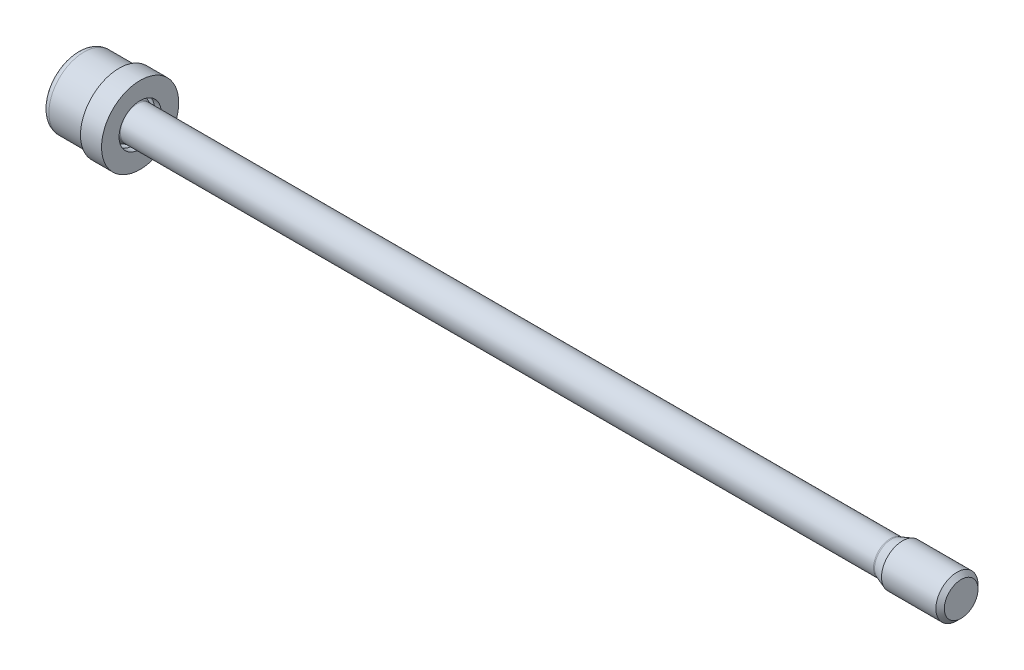
ISO-10303-21;
HEADER;
FILE_DESCRIPTION(('STEP AP214'),'2;1');
FILE_NAME('part.step','',(''),(''),'','','');
FILE_SCHEMA(('AUTOMOTIVE_DESIGN { 1 0 10303 214 1 1 1 1 }'));
ENDSEC;
DATA;
#1=APPLICATION_CONTEXT('core data for automotive mechanical design processes');
#2=APPLICATION_PROTOCOL_DEFINITION('international standard','automotive_design',2000,#1);
#3=PRODUCT_CONTEXT('',#1,'mechanical');
#4=PRODUCT('Part','Part','',(#3));
#5=PRODUCT_RELATED_PRODUCT_CATEGORY('part','',(#4));
#6=PRODUCT_DEFINITION_FORMATION('','',#4);
#7=PRODUCT_DEFINITION_CONTEXT('part definition',#1,'design');
#8=PRODUCT_DEFINITION('design','',#6,#7);
#9=PRODUCT_DEFINITION_SHAPE('','',#8);
#10=(LENGTH_UNIT() NAMED_UNIT(*) SI_UNIT(.MILLI.,.METRE.));
#11=(NAMED_UNIT(*) PLANE_ANGLE_UNIT() SI_UNIT($,.RADIAN.));
#12=(NAMED_UNIT(*) SI_UNIT($,.STERADIAN.) SOLID_ANGLE_UNIT());
#13=UNCERTAINTY_MEASURE_WITH_UNIT(LENGTH_MEASURE(1.E-05),#10,'distance_accuracy_value','');
#14=(GEOMETRIC_REPRESENTATION_CONTEXT(3) GLOBAL_UNCERTAINTY_ASSIGNED_CONTEXT((#13)) GLOBAL_UNIT_ASSIGNED_CONTEXT((#10,
#11,#12)) REPRESENTATION_CONTEXT('',''));
#15=CARTESIAN_POINT('',(0.,0.,0.));
#16=DIRECTION('',(0.,0.,1.));
#17=DIRECTION('',(1.,0.,0.));
#18=AXIS2_PLACEMENT_3D('',#15,#16,#17);
#19=CARTESIAN_POINT('',(6.,3.75,0.));
#20=DIRECTION('',(1.,0.,0.));
#21=DIRECTION('',(0.,0.,-1.));
#22=AXIS2_PLACEMENT_3D('',#19,#20,#21);
#23=PLANE('',#22);
#24=CARTESIAN_POINT('',(6.,0.,0.));
#25=DIRECTION('',(-1.,0.,0.));
#26=DIRECTION('',(0.,0.,1.));
#27=AXIS2_PLACEMENT_3D('',#24,#25,#26);
#28=CIRCLE('',#27,3.75);
#29=CARTESIAN_POINT('',(6.,0.,3.75));
#30=VERTEX_POINT('',#29);
#31=EDGE_CURVE('E62',#30,#30,#28,.T.);
#32=ORIENTED_EDGE('',*,*,#31,.F.);
#33=EDGE_LOOP('',(#32));
#34=FACE_BOUND('',#33,.T.);
#35=CARTESIAN_POINT('',(6.,0.,0.));
#36=DIRECTION('',(-1.,0.,0.));
#37=DIRECTION('',(0.,0.,1.));
#38=AXIS2_PLACEMENT_3D('',#35,#36,#37);
#39=CIRCLE('',#38,5.5);
#40=CARTESIAN_POINT('',(6.,0.,5.5));
#41=VERTEX_POINT('',#40);
#42=EDGE_CURVE('E11',#41,#41,#39,.T.);
#43=ORIENTED_EDGE('',*,*,#42,.T.);
#44=EDGE_LOOP('',(#43));
#45=FACE_BOUND('',#44,.T.);
#46=ADVANCED_FACE('F43',(#34,#45),#23,.F.);
#47=CARTESIAN_POINT('',(0.,0.,0.));
#48=DIRECTION('',(-1.,0.,0.));
#49=DIRECTION('',(0.,0.,1.));
#50=AXIS2_PLACEMENT_3D('',#47,#48,#49);
#51=CYLINDRICAL_SURFACE('',#50,5.5);
#52=ORIENTED_EDGE('',*,*,#42,.F.);
#53=EDGE_LOOP('',(#52));
#54=FACE_BOUND('',#53,.T.);
#55=CARTESIAN_POINT('',(9.,0.,0.));
#56=DIRECTION('',(-1.,0.,0.));
#57=DIRECTION('',(0.,0.,1.));
#58=AXIS2_PLACEMENT_3D('',#55,#56,#57);
#59=CIRCLE('',#58,5.5);
#60=CARTESIAN_POINT('',(9.,0.,5.5));
#61=VERTEX_POINT('',#60);
#62=EDGE_CURVE('E49',#61,#61,#59,.T.);
#63=ORIENTED_EDGE('',*,*,#62,.T.);
#64=EDGE_LOOP('',(#63));
#65=FACE_BOUND('',#64,.T.);
#66=ADVANCED_FACE('F69',(#54,#65),#51,.T.);
#67=CARTESIAN_POINT('',(9.,5.5,0.));
#68=DIRECTION('',(-1.,0.,0.));
#69=DIRECTION('',(0.,0.,1.));
#70=AXIS2_PLACEMENT_3D('',#67,#68,#69);
#71=PLANE('',#70);
#72=ORIENTED_EDGE('',*,*,#62,.F.);
#73=EDGE_LOOP('',(#72));
#74=FACE_BOUND('',#73,.T.);
#75=CARTESIAN_POINT('',(9.,0.,0.));
#76=DIRECTION('',(-1.,0.,0.));
#77=DIRECTION('',(0.,0.,1.));
#78=AXIS2_PLACEMENT_3D('',#75,#76,#77);
#79=CIRCLE('',#78,3.);
#80=CARTESIAN_POINT('',(9.,0.,3.));
#81=VERTEX_POINT('',#80);
#82=EDGE_CURVE('E53',#81,#81,#79,.T.);
#83=ORIENTED_EDGE('',*,*,#82,.T.);
#84=EDGE_LOOP('',(#83));
#85=FACE_BOUND('',#84,.T.);
#86=ADVANCED_FACE('F73',(#74,#85),#71,.F.);
#87=CARTESIAN_POINT('',(0.,0.,0.));
#88=DIRECTION('',(-1.,0.,0.));
#89=DIRECTION('',(0.,0.,1.));
#90=AXIS2_PLACEMENT_3D('',#87,#88,#89);
#91=CYLINDRICAL_SURFACE('',#90,3.);
#92=ORIENTED_EDGE('',*,*,#82,.F.);
#93=EDGE_LOOP('',(#92));
#94=FACE_BOUND('',#93,.T.);
#95=CARTESIAN_POINT('',(8.06060806459101,0.,0.));
#96=DIRECTION('',(-1.,0.,0.));
#97=DIRECTION('',(0.,0.,1.));
#98=AXIS2_PLACEMENT_3D('',#95,#96,#97);
#99=CIRCLE('',#98,3.);
#100=CARTESIAN_POINT('',(8.06060806459101,0.,3.));
#101=VERTEX_POINT('',#100);
#102=EDGE_CURVE('E57',#101,#101,#99,.T.);
#103=ORIENTED_EDGE('',*,*,#102,.T.);
#104=EDGE_LOOP('',(#103));
#105=FACE_BOUND('',#104,.T.);
#106=ADVANCED_FACE('F78',(#94,#105),#91,.F.);
#107=CARTESIAN_POINT('',(6.,0.,0.));
#108=DIRECTION('',(-1.,0.,0.));
#109=DIRECTION('',(0.,0.,1.));
#110=AXIS2_PLACEMENT_3D('',#107,#108,#109);
#111=CONICAL_SURFACE('',#110,3.75,0.34906585039886);
#112=ORIENTED_EDGE('',*,*,#102,.F.);
#113=EDGE_LOOP('',(#112));
#114=FACE_BOUND('',#113,.T.);
#115=ORIENTED_EDGE('',*,*,#31,.T.);
#116=EDGE_LOOP('',(#115));
#117=FACE_BOUND('',#116,.T.);
#118=ADVANCED_FACE('F66',(#114,#117),#111,.F.);
#119=CLOSED_SHELL('',(#46,#66,#86,#106,#118));
#120=MANIFOLD_SOLID_BREP('B2',#119);
#121=CARTESIAN_POINT('',(0.,3.,0.));
#122=DIRECTION('',(-1.,0.,0.));
#123=DIRECTION('',(0.,0.,1.));
#124=AXIS2_PLACEMENT_3D('',#121,#122,#123);
#125=PLANE('',#124);
#126=CARTESIAN_POINT('',(0.,0.,0.));
#127=DIRECTION('',(-1.,0.,0.));
#128=DIRECTION('',(0.,0.,1.));
#129=AXIS2_PLACEMENT_3D('',#126,#127,#128);
#130=CIRCLE('',#129,4.);
#131=CARTESIAN_POINT('',(0.,0.,4.));
#132=VERTEX_POINT('',#131);
#133=EDGE_CURVE('E332',#132,#132,#130,.T.);
#134=ORIENTED_EDGE('',*,*,#133,.T.);
#135=EDGE_LOOP('',(#134));
#136=FACE_BOUND('',#135,.T.);
#137=DIRECTION('',(0.,-0.866025403784439,-0.5));
#138=VECTOR('',#137,1.);
#139=CARTESIAN_POINT('',(0.,2.5,-1.44337567297406));
#140=LINE('',#139,#138);
#141=CARTESIAN_POINT('',(0.,2.5,-1.44337567297406));
#142=VERTEX_POINT('',#141);
#143=CARTESIAN_POINT('',(0.,0.,-2.88675134594813));
#144=VERTEX_POINT('',#143);
#145=EDGE_CURVE('E190',#142,#144,#140,.T.);
#146=ORIENTED_EDGE('',*,*,#145,.F.);
#147=DIRECTION('',(0.,0.,-1.));
#148=VECTOR('',#147,1.);
#149=CARTESIAN_POINT('',(0.,2.5,1.44337567297407));
#150=LINE('',#149,#148);
#151=CARTESIAN_POINT('',(0.,2.5,1.44337567297407));
#152=VERTEX_POINT('',#151);
#153=EDGE_CURVE('E202',#152,#142,#150,.T.);
#154=ORIENTED_EDGE('',*,*,#153,.F.);
#155=DIRECTION('',(0.,0.866025403784439,-0.5));
#156=VECTOR('',#155,1.);
#157=CARTESIAN_POINT('',(0.,0.,2.88675134594813));
#158=LINE('',#157,#156);
#159=CARTESIAN_POINT('',(0.,0.,2.88675134594813));
#160=VERTEX_POINT('',#159);
#161=EDGE_CURVE('E196',#160,#152,#158,.T.);
#162=ORIENTED_EDGE('',*,*,#161,.F.);
#163=DIRECTION('',(0.,0.866025403784438,0.5));
#164=VECTOR('',#163,1.);
#165=CARTESIAN_POINT('',(0.,-2.5,1.44337567297406));
#166=LINE('',#165,#164);
#167=CARTESIAN_POINT('',(0.,-2.5,1.44337567297406));
#168=VERTEX_POINT('',#167);
#169=EDGE_CURVE('E194',#168,#160,#166,.T.);
#170=ORIENTED_EDGE('',*,*,#169,.F.);
#171=DIRECTION('',(0.,0.,1.));
#172=VECTOR('',#171,1.);
#173=CARTESIAN_POINT('',(0.,-2.5,-1.44337567297407));
#174=LINE('',#173,#172);
#175=CARTESIAN_POINT('',(0.,-2.5,-1.44337567297407));
#176=VERTEX_POINT('',#175);
#177=EDGE_CURVE('E177',#176,#168,#174,.T.);
#178=ORIENTED_EDGE('',*,*,#177,.F.);
#179=DIRECTION('',(0.,-0.866025403784439,0.5));
#180=VECTOR('',#179,1.);
#181=CARTESIAN_POINT('',(0.,0.,-2.88675134594813));
#182=LINE('',#181,#180);
#183=EDGE_CURVE('E185',#144,#176,#182,.T.);
#184=ORIENTED_EDGE('',*,*,#183,.F.);
#185=EDGE_LOOP('',(#146,#154,#162,#170,#178,#184));
#186=FACE_BOUND('',#185,.T.);
#187=ADVANCED_FACE('F120',(#136,#186),#125,.T.);
#188=CARTESIAN_POINT('',(0.,0.,0.));
#189=DIRECTION('',(1.,0.,0.));
#190=DIRECTION('',(0.,0.,-1.));
#191=AXIS2_PLACEMENT_3D('',#188,#189,#190);
#192=CYLINDRICAL_SURFACE('',#191,5.);
#193=CARTESIAN_POINT('',(1.,0.,0.));
#194=DIRECTION('',(-1.,0.,0.));
#195=DIRECTION('',(0.,0.,1.));
#196=AXIS2_PLACEMENT_3D('',#193,#194,#195);
#197=CIRCLE('',#196,5.);
#198=CARTESIAN_POINT('',(1.,0.,5.));
#199=VERTEX_POINT('',#198);
#200=EDGE_CURVE('E342',#199,#199,#197,.F.);
#201=ORIENTED_EDGE('',*,*,#200,.T.);
#202=EDGE_LOOP('',(#201));
#203=FACE_BOUND('',#202,.T.);
#204=CARTESIAN_POINT('',(6.,0.,0.));
#205=DIRECTION('',(1.,0.,0.));
#206=DIRECTION('',(0.,0.,-1.));
#207=AXIS2_PLACEMENT_3D('',#204,#205,#206);
#208=CIRCLE('',#207,5.);
#209=CARTESIAN_POINT('',(6.,0.,-5.));
#210=VERTEX_POINT('',#209);
#211=EDGE_CURVE('E345',#210,#210,#208,.T.);
#212=ORIENTED_EDGE('',*,*,#211,.F.);
#213=EDGE_LOOP('',(#212));
#214=FACE_BOUND('',#213,.T.);
#215=ADVANCED_FACE('F297',(#203,#214),#192,.T.);
#216=CARTESIAN_POINT('',(6.,5.,0.));
#217=DIRECTION('',(1.,0.,0.));
#218=DIRECTION('',(0.,0.,-1.));
#219=AXIS2_PLACEMENT_3D('',#216,#217,#218);
#220=PLANE('',#219);
#221=CARTESIAN_POINT('',(6.,0.,0.));
#222=DIRECTION('',(1.,0.,0.));
#223=DIRECTION('',(0.,0.,-1.));
#224=AXIS2_PLACEMENT_3D('',#221,#222,#223);
#225=CIRCLE('',#224,3.66002935477036);
#226=CARTESIAN_POINT('',(6.,0.,-3.66002935477036));
#227=VERTEX_POINT('',#226);
#228=EDGE_CURVE('E41',#227,#227,#225,.F.);
#229=ORIENTED_EDGE('',*,*,#228,.T.);
#230=EDGE_LOOP('',(#229));
#231=FACE_BOUND('',#230,.T.);
#232=ORIENTED_EDGE('',*,*,#211,.T.);
#233=EDGE_LOOP('',(#232));
#234=FACE_BOUND('',#233,.T.);
#235=ADVANCED_FACE('F293',(#231,#234),#220,.T.);
#236=CARTESIAN_POINT('',(8.5,0.,0.));
#237=DIRECTION('',(-1.,0.,0.));
#238=DIRECTION('',(0.,0.,1.));
#239=AXIS2_PLACEMENT_3D('',#236,#237,#238);
#240=CONICAL_SURFACE('',#239,2.4,0.349065850398867);
#241=CARTESIAN_POINT('',(8.4171534186914,0.,0.));
#242=DIRECTION('',(-1.,0.,0.));
#243=DIRECTION('',(0.,0.,1.));
#244=AXIS2_PLACEMENT_3D('',#241,#242,#243);
#245=CIRCLE('',#244,2.43015368960705);
#246=CARTESIAN_POINT('',(8.4171534186914,0.,2.43015368960705));
#247=VERTEX_POINT('',#246);
#248=EDGE_CURVE('E128',#247,#247,#245,.T.);
#249=ORIENTED_EDGE('',*,*,#248,.T.);
#250=EDGE_LOOP('',(#249));
#251=FACE_BOUND('',#250,.T.);
#252=CARTESIAN_POINT('',(6.32898992833717,0.,0.));
#253=DIRECTION('',(-1.,0.,0.));
#254=DIRECTION('',(0.,0.,1.));
#255=AXIS2_PLACEMENT_3D('',#252,#253,#254);
#256=CIRCLE('',#255,3.19018304437741);
#257=CARTESIAN_POINT('',(6.32898992833717,0.,3.19018304437741));
#258=VERTEX_POINT('',#257);
#259=EDGE_CURVE('E329',#258,#258,#256,.F.);
#260=ORIENTED_EDGE('',*,*,#259,.T.);
#261=EDGE_LOOP('',(#260));
#262=FACE_BOUND('',#261,.T.);
#263=ADVANCED_FACE('F289',(#251,#262),#240,.T.);
#264=CARTESIAN_POINT('',(0.,0.,0.));
#265=DIRECTION('',(1.,0.,0.));
#266=DIRECTION('',(0.,0.,-1.));
#267=AXIS2_PLACEMENT_3D('',#264,#265,#266);
#268=CYLINDRICAL_SURFACE('',#267,2.4);
#269=CARTESIAN_POINT('',(115.911836509646,0.,0.));
#270=DIRECTION('',(1.,0.,0.));
#271=DIRECTION('',(0.,0.,-1.));
#272=AXIS2_PLACEMENT_3D('',#269,#270,#271);
#273=CIRCLE('',#272,2.4);
#274=CARTESIAN_POINT('',(115.911836509646,0.,-2.4));
#275=VERTEX_POINT('',#274);
#276=EDGE_CURVE('E325',#275,#275,#273,.F.);
#277=ORIENTED_EDGE('',*,*,#276,.T.);
#278=EDGE_LOOP('',(#277));
#279=FACE_BOUND('',#278,.T.);
#280=CARTESIAN_POINT('',(8.58816349035423,0.,0.));
#281=DIRECTION('',(1.,0.,0.));
#282=DIRECTION('',(0.,0.,-1.));
#283=AXIS2_PLACEMENT_3D('',#280,#281,#282);
#284=CIRCLE('',#283,2.4);
#285=CARTESIAN_POINT('',(8.58816349035423,0.,-2.4));
#286=VERTEX_POINT('',#285);
#287=EDGE_CURVE('E323',#286,#286,#284,.T.);
#288=ORIENTED_EDGE('',*,*,#287,.T.);
#289=EDGE_LOOP('',(#288));
#290=FACE_BOUND('',#289,.T.);
#291=ADVANCED_FACE('F285',(#279,#290),#268,.T.);
#292=CARTESIAN_POINT('',(117.648486451673,0.,0.));
#293=DIRECTION('',(1.,0.,0.));
#294=DIRECTION('',(0.,0.,-1.));
#295=AXIS2_PLACEMENT_3D('',#292,#293,#294);
#296=CONICAL_SURFACE('',#295,3.00000000000001,0.349065850398867);
#297=CARTESIAN_POINT('',(116.082846581309,0.,0.));
#298=DIRECTION('',(1.,0.,0.));
#299=DIRECTION('',(0.,0.,-1.));
#300=AXIS2_PLACEMENT_3D('',#297,#298,#299);
#301=CIRCLE('',#300,2.43015368960705);
#302=CARTESIAN_POINT('',(116.082846581309,0.,-2.43015368960705));
#303=VERTEX_POINT('',#302);
#304=EDGE_CURVE('E326',#303,#303,#301,.T.);
#305=ORIENTED_EDGE('',*,*,#304,.T.);
#306=EDGE_LOOP('',(#305));
#307=FACE_BOUND('',#306,.T.);
#308=CARTESIAN_POINT('',(117.648486451673,0.,0.));
#309=DIRECTION('',(1.,0.,0.));
#310=DIRECTION('',(0.,0.,-1.));
#311=AXIS2_PLACEMENT_3D('',#308,#309,#310);
#312=CIRCLE('',#311,3.00000000000001);
#313=CARTESIAN_POINT('',(117.648486451673,0.,-3.00000000000001));
#314=VERTEX_POINT('',#313);
#315=EDGE_CURVE('E348',#314,#314,#312,.T.);
#316=ORIENTED_EDGE('',*,*,#315,.F.);
#317=EDGE_LOOP('',(#316));
#318=FACE_BOUND('',#317,.T.);
#319=ADVANCED_FACE('F281',(#307,#318),#296,.T.);
#320=CARTESIAN_POINT('',(0.,0.,0.));
#321=DIRECTION('',(1.,0.,0.));
#322=DIRECTION('',(0.,0.,-1.));
#323=AXIS2_PLACEMENT_3D('',#320,#321,#322);
#324=CYLINDRICAL_SURFACE('',#323,3.00000000000001);
#325=ORIENTED_EDGE('',*,*,#315,.T.);
#326=EDGE_LOOP('',(#325));
#327=FACE_BOUND('',#326,.T.);
#328=CARTESIAN_POINT('',(125.4,0.,0.));
#329=DIRECTION('',(1.,0.,0.));
#330=DIRECTION('',(0.,0.,-1.));
#331=AXIS2_PLACEMENT_3D('',#328,#329,#330);
#332=CIRCLE('',#331,3.00000000000001);
#333=CARTESIAN_POINT('',(125.4,0.,-3.00000000000001));
#334=VERTEX_POINT('',#333);
#335=EDGE_CURVE('E350',#334,#334,#332,.T.);
#336=ORIENTED_EDGE('',*,*,#335,.F.);
#337=EDGE_LOOP('',(#336));
#338=FACE_BOUND('',#337,.T.);
#339=ADVANCED_FACE('F277',(#327,#338),#324,.T.);
#340=CARTESIAN_POINT('',(126.,0.,0.));
#341=DIRECTION('',(-1.,0.,0.));
#342=DIRECTION('',(0.,0.,1.));
#343=AXIS2_PLACEMENT_3D('',#340,#341,#342);
#344=CONICAL_SURFACE('',#343,2.4,0.785398163397422);
#345=ORIENTED_EDGE('',*,*,#335,.T.);
#346=EDGE_LOOP('',(#345));
#347=FACE_BOUND('',#346,.T.);
#348=CARTESIAN_POINT('',(126.,0.,0.));
#349=DIRECTION('',(1.,0.,0.));
#350=DIRECTION('',(0.,0.,-1.));
#351=AXIS2_PLACEMENT_3D('',#348,#349,#350);
#352=CIRCLE('',#351,2.4);
#353=CARTESIAN_POINT('',(126.,0.,-2.4));
#354=VERTEX_POINT('',#353);
#355=EDGE_CURVE('E220',#354,#354,#352,.T.);
#356=ORIENTED_EDGE('',*,*,#355,.F.);
#357=EDGE_LOOP('',(#356));
#358=FACE_BOUND('',#357,.T.);
#359=ADVANCED_FACE('F273',(#347,#358),#344,.T.);
#360=CARTESIAN_POINT('',(126.,2.4,0.));
#361=DIRECTION('',(1.,0.,0.));
#362=DIRECTION('',(0.,0.,-1.));
#363=AXIS2_PLACEMENT_3D('',#360,#361,#362);
#364=PLANE('',#363);
#365=ORIENTED_EDGE('',*,*,#355,.T.);
#366=EDGE_LOOP('',(#365));
#367=FACE_BOUND('',#366,.T.);
#368=ADVANCED_FACE('F270',(#367),#364,.T.);
#369=CARTESIAN_POINT('',(126.001,0.,-2.88675134594813));
#370=DIRECTION('',(0.,-0.5,-0.866025403784439));
#371=DIRECTION('',(0.,0.866025403784439,-0.5));
#372=AXIS2_PLACEMENT_3D('',#369,#370,#371);
#373=PLANE('',#372);
#374=DIRECTION('',(-1.,0.,0.));
#375=VECTOR('',#374,1.);
#376=CARTESIAN_POINT('',(126.001,-2.5,-1.44337567297407));
#377=LINE('',#376,#375);
#378=CARTESIAN_POINT('',(3.06538414090221,-2.5,-1.44337567297407));
#379=VERTEX_POINT('',#378);
#380=EDGE_CURVE('E173',#379,#176,#377,.T.);
#381=ORIENTED_EDGE('',*,*,#380,.F.);
#382=CARTESIAN_POINT('',(3.0653174702357,-2.5002,-1.44326020292023));
#383=CARTESIAN_POINT('',(3.10195351448719,-2.39033676526513,-1.50668977106845));
#384=CARTESIAN_POINT('',(3.13527291562976,-2.27952520010347,-1.57066685804385));
#385=CARTESIAN_POINT('',(3.19343284903695,-2.05598316653395,-1.69972891130041));
#386=CARTESIAN_POINT('',(3.21825280544707,-1.94324872547161,-1.7648161711947));
#387=CARTESIAN_POINT('',(3.25688948315376,-1.71917700612473,-1.8941840386774));
#388=CARTESIAN_POINT('',(3.27096333840917,-1.60787420823262,-1.95844473900197));
#389=CARTESIAN_POINT('',(3.28776598224206,-1.38474477253167,-2.08726857876804));
#390=CARTESIAN_POINT('',(3.29050868339118,-1.27291894598577,-2.15183124982667));
#391=CARTESIAN_POINT('',(3.28480937458676,-1.06395802444848,-2.27247489412634));
#392=CARTESIAN_POINT('',(3.27776674021295,-0.966791682442268,-2.32857390783979));
#393=CARTESIAN_POINT('',(3.25544371546987,-0.773092050288997,-2.44040644260542));
#394=CARTESIAN_POINT('',(3.24015569615454,-0.676559430340267,-2.4961395767184));
#395=CARTESIAN_POINT('',(3.20193604075039,-0.482460278259523,-2.60820277442169));
#396=CARTESIAN_POINT('',(3.1788423584693,-0.384918318217858,-2.66451865130903));
#397=CARTESIAN_POINT('',(3.1264284780169,-0.191289391923914,-2.77631036402774));
#398=CARTESIAN_POINT('',(3.09712059897026,-0.0951999441138228,-2.83178763258718));
#399=CARTESIAN_POINT('',(3.0653174702357,0.000200000000000971,-2.88686681600197));
#400=B_SPLINE_CURVE_WITH_KNOTS('',3,(#382,#383,#384,#385,#386,#387,#388,#389,#390,#391,#392,
#393,#394,#395,#396,#397,#398,#399),.UNSPECIFIED.,.F.,.F.,(4,2,2,2,2,2,2,2,4),(0.,
0.396285827362226,0.793524330152051,1.18093086852114,1.56786160134475,1.90479741793733,
2.24204551660463,2.58677531536756,2.93082800105256),.UNSPECIFIED.);
#401=CARTESIAN_POINT('',(3.06538414090221,0.,-2.88675134594813));
#402=VERTEX_POINT('',#401);
#403=EDGE_CURVE('E135',#379,#402,#400,.T.);
#404=ORIENTED_EDGE('',*,*,#403,.T.);
#405=DIRECTION('',(-1.,0.,0.));
#406=VECTOR('',#405,1.);
#407=CARTESIAN_POINT('',(126.001,0.,-2.88675134594813));
#408=LINE('',#407,#406);
#409=EDGE_CURVE('E182',#402,#144,#408,.T.);
#410=ORIENTED_EDGE('',*,*,#409,.T.);
#411=ORIENTED_EDGE('',*,*,#183,.T.);
#412=EDGE_LOOP('',(#381,#404,#410,#411));
#413=FACE_BOUND('',#412,.T.);
#414=ADVANCED_FACE('F186',(#413),#373,.F.);
#415=CARTESIAN_POINT('',(126.001,-2.5,-1.44337567297407));
#416=DIRECTION('',(0.,-1.,0.));
#417=DIRECTION('',(0.,0.,-1.));
#418=AXIS2_PLACEMENT_3D('',#415,#416,#417);
#419=PLANE('',#418);
#420=DIRECTION('',(-1.,0.,0.));
#421=VECTOR('',#420,1.);
#422=CARTESIAN_POINT('',(126.001,-2.5,1.44337567297406));
#423=LINE('',#422,#421);
#424=CARTESIAN_POINT('',(3.06538414090221,-2.5,1.44337567297406));
#425=VERTEX_POINT('',#424);
#426=EDGE_CURVE('E181',#425,#168,#423,.T.);
#427=ORIENTED_EDGE('',*,*,#426,.F.);
#428=CARTESIAN_POINT('',(2.12636842345551,-2.5,-3.75749145849147));
#429=CARTESIAN_POINT('',(2.17840730126994,-2.5,-3.64919841245765));
#430=CARTESIAN_POINT('',(2.22991109081443,-2.5,-3.54064339523085));
#431=CARTESIAN_POINT('',(2.33154466807991,-2.5,-3.3228694955171));
#432=CARTESIAN_POINT('',(2.38167421161515,-2.5,-3.21365049920821));
#433=CARTESIAN_POINT('',(2.4805337544965,-2.5,-2.99378661217995));
#434=CARTESIAN_POINT('',(2.52925350352944,-2.5,-2.88313709525642));
#435=CARTESIAN_POINT('',(2.62453076962273,-2.5,-2.66091438051196));
#436=CARTESIAN_POINT('',(2.67108839828446,-2.5,-2.54934123071691));
#437=CARTESIAN_POINT('',(2.76268020358821,-2.5,-2.32208129370502));
#438=CARTESIAN_POINT('',(2.80764011051455,-2.5,-2.20636439807093));
#439=CARTESIAN_POINT('',(2.8938583204999,-2.5,-1.97353370647439));
#440=CARTESIAN_POINT('',(2.93511619281195,-2.5,-1.85641974974959));
#441=CARTESIAN_POINT('',(3.01275931437895,-2.5,-1.62086916274625));
#442=CARTESIAN_POINT('',(3.04915554799201,-2.5,-1.5024361923926));
#443=CARTESIAN_POINT('',(3.11583031127494,-2.5,-1.26387801946515));
#444=CARTESIAN_POINT('',(3.14611089728492,-2.5,-1.14375340027707));
#445=CARTESIAN_POINT('',(3.1988834258473,-2.5,-0.902338315637485));
#446=CARTESIAN_POINT('',(3.22140975998488,-2.5,-0.781055515829784));
#447=CARTESIAN_POINT('',(3.25730646557173,-2.5,-0.537116621010969));
#448=CARTESIAN_POINT('',(3.27067748885287,-2.5,-0.414460624399614));
#449=CARTESIAN_POINT('',(3.287022334139,-2.5,-0.169933632334297));
#450=CARTESIAN_POINT('',(3.29012016324679,-2.5,-0.0480711308396707));
#451=CARTESIAN_POINT('',(3.28597573178245,-2.5,0.19548591265525));
#452=CARTESIAN_POINT('',(3.27873285516471,-2.5,0.317180444216426));
#453=CARTESIAN_POINT('',(3.25777388069378,-2.5,0.527456408829613));
#454=CARTESIAN_POINT('',(3.24628060785313,-2.5,0.616270494700837));
#455=CARTESIAN_POINT('',(3.21857052983102,-2.5,0.793165661516789));
#456=CARTESIAN_POINT('',(3.20235297879511,-2.5,0.881246624458082));
#457=CARTESIAN_POINT('',(3.14747296332912,-2.5,1.14430390665101));
#458=CARTESIAN_POINT('',(3.1025954799091,-2.5,1.317984412454));
#459=CARTESIAN_POINT('',(2.99987041239151,-2.5,1.66560393982868));
#460=CARTESIAN_POINT('',(2.94175242280195,-2.5,1.83945995399085));
#461=CARTESIAN_POINT('',(2.84820982121638,-2.5,2.09786165724551));
#462=CARTESIAN_POINT('',(2.81597294206815,-2.5,2.18358675226303));
#463=CARTESIAN_POINT('',(2.74971773361361,-2.5,2.35434488656641));
#464=CARTESIAN_POINT('',(2.71569943468296,-2.5,2.43937793762404));
#465=CARTESIAN_POINT('',(2.62609143927397,-2.5,2.65783078906444));
#466=CARTESIAN_POINT('',(2.56940246137258,-2.5,2.79079865626203));
#467=CARTESIAN_POINT('',(2.45324874031999,-2.5,3.05552029876381));
#468=CARTESIAN_POINT('',(2.39378378784884,-2.5,3.18727398161362));
#469=CARTESIAN_POINT('',(2.27270940087484,-2.5,3.44982929016523));
#470=CARTESIAN_POINT('',(2.21109943532155,-2.5,3.58063067026957));
#471=CARTESIAN_POINT('',(2.08621423183453,-2.5,3.84143730957473));
#472=CARTESIAN_POINT('',(2.02293895605817,-2.5,3.97144255060114));
#473=CARTESIAN_POINT('',(1.83100339380671,-2.5,4.36080606143232));
#474=CARTESIAN_POINT('',(1.70038124495656,-2.5,4.61919627423268));
#475=CARTESIAN_POINT('',(1.43577817267015,-2.5,5.13419069650057));
#476=CARTESIAN_POINT('',(1.30179775266331,-2.5,5.39079516638233));
#477=CARTESIAN_POINT('',(1.04443333112509,-2.5,5.87829290077643));
#478=CARTESIAN_POINT('',(0.921261270423659,-2.5,6.1092982358284));
#479=CARTESIAN_POINT('',(0.673512402732434,-2.5,6.57056638390016));
#480=CARTESIAN_POINT('',(0.548935533926602,-2.5,6.8008291636673));
#481=CARTESIAN_POINT('',(0.299056267226439,-2.5,7.26018235458172));
#482=CARTESIAN_POINT('',(0.173756607898793,-2.5,7.48927425711587));
#483=CARTESIAN_POINT('',(-0.0776565907082638,-2.5,7.94699348590568));
#484=CARTESIAN_POINT('',(-0.203770081171649,-2.5,8.1756208389644));
#485=CARTESIAN_POINT('',(-0.33018177744971,-2.5,8.40408211730898));
#486=B_SPLINE_CURVE_WITH_KNOTS('',3,(#428,#429,#430,#431,#432,#433,#434,#435,#436,#437,#438,
#439,#440,#441,#442,#443,#444,#445,#446,#447,#448,#449,#450,#451,#452,#453,#454,#455,#456,#457,
#458,#459,#460,#461,#462,#463,#464,#465,#466,#467,#468,#469,#470,#471,#472,#473,#474,#475,#476,
#477,#478,#479,#480,#481,#482,#483,#484,#485),.UNSPECIFIED.,.F.,.F.,(4,2,2,2,2,2,2,2,2,2,2,2,2,
2,2,2,2,2,2,2,2,2,2,2,2,2,2,2,4),(0.,0.360447630601902,0.720958898327138,1.08364194517046,
1.44630625067838,1.81869010849736,2.19111723867755,2.56268813804158,2.93413389074121,
3.30391031832936,3.6736604161591,4.03893071561303,4.40422277688467,4.67275529541628,
4.94133023203033,5.478811279852,6.02844936413291,6.30319202048782,6.57792999362449,
7.01152865074963,7.44516005598384,7.87889959153572,8.31264899193852,9.18119380679301,
10.0496091900455,10.8349772933876,11.6203800913395,12.4037350974485,13.1870435444301),.UNSPECIFIED.);
#487=EDGE_CURVE('E180',#425,#379,#486,.F.);
#488=ORIENTED_EDGE('',*,*,#487,.T.);
#489=ORIENTED_EDGE('',*,*,#380,.T.);
#490=ORIENTED_EDGE('',*,*,#177,.T.);
#491=EDGE_LOOP('',(#427,#488,#489,#490));
#492=FACE_BOUND('',#491,.T.);
#493=ADVANCED_FACE('F175',(#492),#419,.F.);
#494=CARTESIAN_POINT('',(126.001,-2.5,1.44337567297406));
#495=DIRECTION('',(0.,-0.5,0.866025403784438));
#496=DIRECTION('',(0.,-0.866025403784439,-0.5));
#497=AXIS2_PLACEMENT_3D('',#494,#495,#496);
#498=PLANE('',#497);
#499=DIRECTION('',(-1.,0.,0.));
#500=VECTOR('',#499,1.);
#501=CARTESIAN_POINT('',(126.001,0.,2.88675134594813));
#502=LINE('',#501,#500);
#503=CARTESIAN_POINT('',(3.06538414090221,0.,2.88675134594813));
#504=VERTEX_POINT('',#503);
#505=EDGE_CURVE('E209',#504,#160,#502,.T.);
#506=ORIENTED_EDGE('',*,*,#505,.F.);
#507=CARTESIAN_POINT('',(3.0653174702357,0.000200000000001228,2.88686681600197));
#508=CARTESIAN_POINT('',(3.10195351448719,-0.10966323473487,2.82343724785375));
#509=CARTESIAN_POINT('',(3.13527291562976,-0.220474799896524,2.75946016087834));
#510=CARTESIAN_POINT('',(3.19343284903695,-0.444016833466048,2.63039810762178));
#511=CARTESIAN_POINT('',(3.21825280544707,-0.556751274528387,2.5653108477275));
#512=CARTESIAN_POINT('',(3.25688948315376,-0.780822993875267,2.43594298024479));
#513=CARTESIAN_POINT('',(3.27096333840917,-0.892125791767375,2.37168227992023));
#514=CARTESIAN_POINT('',(3.28776598224206,-1.11525522746833,2.24285844015415));
#515=CARTESIAN_POINT('',(3.29050868339119,-1.22708105401422,2.17829576909553));
#516=CARTESIAN_POINT('',(3.28480937458676,-1.43604197555152,2.05765212479586));
#517=CARTESIAN_POINT('',(3.27776674021295,-1.53320831755773,2.0015531110824));
#518=CARTESIAN_POINT('',(3.25544371546987,-1.726907949711,1.88972057631678));
#519=CARTESIAN_POINT('',(3.24015569615455,-1.82344056965973,1.8339874422038));
#520=CARTESIAN_POINT('',(3.20193604075039,-2.01753972174047,1.7219242445005));
#521=CARTESIAN_POINT('',(3.1788423584693,-2.11508168178214,1.66560836761316));
#522=CARTESIAN_POINT('',(3.1264284780169,-2.30871060807608,1.55381665489446));
#523=CARTESIAN_POINT('',(3.09712059897026,-2.40480005588618,1.49833938633502));
#524=CARTESIAN_POINT('',(3.0653174702357,-2.5002,1.44326020292023));
#525=B_SPLINE_CURVE_WITH_KNOTS('',3,(#507,#508,#509,#510,#511,#512,#513,#514,#515,#516,#517,
#518,#519,#520,#521,#522,#523,#524),.UNSPECIFIED.,.F.,.F.,(4,2,2,2,2,2,2,2,4),(0.,
0.396285827362226,0.79352433015205,1.18093086852114,1.56786160134475,1.90479741793733,
2.24204551660463,2.58677531536756,2.93082800105257),.UNSPECIFIED.);
#526=EDGE_CURVE('E241',#504,#425,#525,.T.);
#527=ORIENTED_EDGE('',*,*,#526,.T.);
#528=ORIENTED_EDGE('',*,*,#426,.T.);
#529=ORIENTED_EDGE('',*,*,#169,.T.);
#530=EDGE_LOOP('',(#506,#527,#528,#529));
#531=FACE_BOUND('',#530,.T.);
#532=ADVANCED_FACE('F371',(#531),#498,.F.);
#533=CARTESIAN_POINT('',(126.001,0.,2.88675134594813));
#534=DIRECTION('',(0.,0.5,0.866025403784439));
#535=DIRECTION('',(0.,-0.866025403784439,0.5));
#536=AXIS2_PLACEMENT_3D('',#533,#534,#535);
#537=PLANE('',#536);
#538=DIRECTION('',(-1.,0.,0.));
#539=VECTOR('',#538,1.);
#540=CARTESIAN_POINT('',(126.001,2.5,1.44337567297407));
#541=LINE('',#540,#539);
#542=CARTESIAN_POINT('',(3.06538414090221,2.5,1.44337567297407));
#543=VERTEX_POINT('',#542);
#544=EDGE_CURVE('E207',#543,#152,#541,.T.);
#545=ORIENTED_EDGE('',*,*,#544,.F.);
#546=CARTESIAN_POINT('',(3.0653174702357,2.5002,1.44326020292023));
#547=CARTESIAN_POINT('',(3.10195351448719,2.39033676526513,1.50668977106845));
#548=CARTESIAN_POINT('',(3.13527291562976,2.27952520010348,1.57066685804385));
#549=CARTESIAN_POINT('',(3.19343284903695,2.05598316653395,1.69972891130042));
#550=CARTESIAN_POINT('',(3.21825280544707,1.94324872547161,1.7648161711947));
#551=CARTESIAN_POINT('',(3.25688948315376,1.71917700612473,1.8941840386774));
#552=CARTESIAN_POINT('',(3.27096333840917,1.60787420823262,1.95844473900197));
#553=CARTESIAN_POINT('',(3.28776598224206,1.38474477253167,2.08726857876805));
#554=CARTESIAN_POINT('',(3.29050868339118,1.27291894598577,2.15183124982667));
#555=CARTESIAN_POINT('',(3.28480937458676,1.06395802444848,2.27247489412634));
#556=CARTESIAN_POINT('',(3.27776674021295,0.966791682442269,2.32857390783979));
#557=CARTESIAN_POINT('',(3.25544371546987,0.773092050288998,2.44040644260542));
#558=CARTESIAN_POINT('',(3.24015569615454,0.676559430340268,2.4961395767184));
#559=CARTESIAN_POINT('',(3.20193604075039,0.482460278259525,2.60820277442169));
#560=CARTESIAN_POINT('',(3.1788423584693,0.38491831821786,2.66451865130903));
#561=CARTESIAN_POINT('',(3.1264284780169,0.191289391923916,2.77631036402774));
#562=CARTESIAN_POINT('',(3.09712059897026,0.0951999441138252,2.83178763258718));
#563=CARTESIAN_POINT('',(3.0653174702357,-0.0001999999999987,2.88686681600197));
#564=B_SPLINE_CURVE_WITH_KNOTS('',3,(#546,#547,#548,#549,#550,#551,#552,#553,#554,#555,#556,
#557,#558,#559,#560,#561,#562,#563),.UNSPECIFIED.,.F.,.F.,(4,2,2,2,2,2,2,2,4),(0.,
0.396285827362227,0.793524330152051,1.18093086852114,1.56786160134475,1.90479741793733,
2.24204551660463,2.58677531536756,2.93082800105256),.UNSPECIFIED.);
#565=EDGE_CURVE('E247',#543,#504,#564,.T.);
#566=ORIENTED_EDGE('',*,*,#565,.T.);
#567=ORIENTED_EDGE('',*,*,#505,.T.);
#568=ORIENTED_EDGE('',*,*,#161,.T.);
#569=EDGE_LOOP('',(#545,#566,#567,#568));
#570=FACE_BOUND('',#569,.T.);
#571=ADVANCED_FACE('F361',(#570),#537,.F.);
#572=CARTESIAN_POINT('',(126.001,2.5,1.44337567297407));
#573=DIRECTION('',(0.,1.,0.));
#574=DIRECTION('',(0.,0.,1.));
#575=AXIS2_PLACEMENT_3D('',#572,#573,#574);
#576=PLANE('',#575);
#577=DIRECTION('',(-1.,0.,0.));
#578=VECTOR('',#577,1.);
#579=CARTESIAN_POINT('',(126.001,2.5,-1.44337567297406));
#580=LINE('',#579,#578);
#581=CARTESIAN_POINT('',(3.06538414090221,2.5,-1.44337567297406));
#582=VERTEX_POINT('',#581);
#583=EDGE_CURVE('E205',#582,#142,#580,.T.);
#584=ORIENTED_EDGE('',*,*,#583,.F.);
#585=CARTESIAN_POINT('',(2.12636842374781,2.5,-3.75749145788336));
#586=CARTESIAN_POINT('',(2.17840730154986,2.5,-3.64919841186993));
#587=CARTESIAN_POINT('',(2.22991109108197,2.5,-3.54064339466354));
#588=CARTESIAN_POINT('',(2.33154466832276,2.5,-3.32286949499067));
#589=CARTESIAN_POINT('',(2.38167421184568,2.5,-3.21365049870226));
#590=CARTESIAN_POINT('',(2.48053375470237,2.5,-2.99378661171531));
#591=CARTESIAN_POINT('',(2.52925350372298,2.5,-2.88313709481262));
#592=CARTESIAN_POINT('',(2.6245307697918,2.5,-2.66091438011));
#593=CARTESIAN_POINT('',(2.67108839844142,2.5,-2.54934123033594));
#594=CARTESIAN_POINT('',(2.76268020372084,2.5,-2.32208129336721));
#595=CARTESIAN_POINT('',(2.80764011063499,2.5,-2.2063643977553));
#596=CARTESIAN_POINT('',(2.89385832059665,2.5,-1.9735337062035));
#597=CARTESIAN_POINT('',(2.9351161928972,2.5,-1.85641974950126));
#598=CARTESIAN_POINT('',(3.0127593144424,2.5,-1.62086916254346));
#599=CARTESIAN_POINT('',(3.04915554804515,2.5,-1.5024361922128));
#600=CARTESIAN_POINT('',(3.11583031130928,2.5,-1.26387801933197));
#601=CARTESIAN_POINT('',(3.14611089731076,2.5,-1.14375340016753));
#602=CARTESIAN_POINT('',(3.19888342585617,2.5,-0.902338315588318));
#603=CARTESIAN_POINT('',(3.22140975998604,2.5,-0.781055515817529));
#604=CARTESIAN_POINT('',(3.2573064655632,2.5,-0.537116621073319));
#605=CARTESIAN_POINT('',(3.27067748884234,2.5,-0.414460624499657));
#606=CARTESIAN_POINT('',(3.28702233413111,2.5,-0.16993363250906));
#607=CARTESIAN_POINT('',(3.29012016324342,2.5,-0.0480711310514564));
#608=CARTESIAN_POINT('',(3.28597573179428,2.5,0.195485912370101));
#609=CARTESIAN_POINT('',(3.27873285518723,2.5,0.317180443894937));
#610=CARTESIAN_POINT('',(3.25777388073756,2.5,0.527456408460891));
#611=CARTESIAN_POINT('',(3.24628060790553,2.5,0.616270494320829));
#612=CARTESIAN_POINT('',(3.21857052990114,2.5,0.793165661114662));
#613=CARTESIAN_POINT('',(3.20235297887432,2.5,0.881246624045123));
#614=CARTESIAN_POINT('',(3.14747296343585,2.5,1.14430390620608));
#615=CARTESIAN_POINT('',(3.10259548003446,2.5,1.31798441198846));
#616=CARTESIAN_POINT('',(2.99987041255385,2.5,1.66560393932173));
#617=CARTESIAN_POINT('',(2.94175242298264,2.5,1.8394599534631));
#618=CARTESIAN_POINT('',(2.84820982142381,2.5,2.09786165668668));
#619=CARTESIAN_POINT('',(2.81597294228436,2.5,2.18358675169387));
#620=CARTESIAN_POINT('',(2.74971773384711,2.5,2.3543448859766));
#621=CARTESIAN_POINT('',(2.71569943492498,2.5,2.4393779370239));
#622=CARTESIAN_POINT('',(2.62609143952949,2.5,2.65783078845754));
#623=CARTESIAN_POINT('',(2.56940246163236,2.5,2.79079865565848));
#624=CARTESIAN_POINT('',(2.4532487405871,2.5,3.05552029816652));
#625=CARTESIAN_POINT('',(2.39378378811902,2.5,3.18727398101926));
#626=CARTESIAN_POINT('',(2.27270940115027,2.5,3.44982928957641));
#627=CARTESIAN_POINT('',(2.21109943559917,2.5,3.58063066968337));
#628=CARTESIAN_POINT('',(2.0862142321159,2.5,3.84143730899351));
#629=CARTESIAN_POINT('',(2.0229389563411,2.5,3.97144255002228));
#630=CARTESIAN_POINT('',(1.83100339409351,2.5,4.36080606086044));
#631=CARTESIAN_POINT('',(1.70038124524498,2.5,4.61919627366512));
#632=CARTESIAN_POINT('',(1.43577817296076,2.5,5.1341906959411));
#633=CARTESIAN_POINT('',(1.30179775295451,2.5,5.39079516582663));
#634=CARTESIAN_POINT('',(1.04443333141861,2.5,5.87829290022415));
#635=CARTESIAN_POINT('',(0.921261270719009,2.5,6.1092982352758));
#636=CARTESIAN_POINT('',(0.67351240303112,2.5,6.57056638334676));
#637=CARTESIAN_POINT('',(0.548935534226794,2.5,6.80082916311342));
#638=CARTESIAN_POINT('',(0.299056267529652,2.5,7.26018235402635));
#639=CARTESIAN_POINT('',(0.173756608203524,2.5,7.48927425655949));
#640=CARTESIAN_POINT('',(-0.077656590400648,2.5,7.94699348534719));
#641=CARTESIAN_POINT('',(-0.203770080862667,2.5,8.1756208384048));
#642=CARTESIAN_POINT('',(-0.330181777139411,2.5,8.40408211674825));
#643=B_SPLINE_CURVE_WITH_KNOTS('',3,(#585,#586,#587,#588,#589,#590,#591,#592,#593,#594,#595,
#596,#597,#598,#599,#600,#601,#602,#603,#604,#605,#606,#607,#608,#609,#610,#611,#612,#613,#614,
#615,#616,#617,#618,#619,#620,#621,#622,#623,#624,#625,#626,#627,#628,#629,#630,#631,#632,#633,
#634,#635,#636,#637,#638,#639,#640,#641,#642),.UNSPECIFIED.,.F.,.F.,(4,2,2,2,2,2,2,2,2,2,2,2,2,
2,2,2,2,2,2,2,2,2,2,2,2,2,2,2,4),(0.,0.360447630530673,0.720958898184668,1.08364194495586,
1.44630625039164,1.81869010813537,2.1911172382403,2.56268813752937,2.93413389015409,
3.30391031762941,3.67366041534648,4.03893071469013,4.4042227758514,4.67275529434612,
4.94133023092328,5.47881127867106,6.02844936287524,6.30319201919188,6.57792999229027,
7.01152864941958,7.44516005465798,7.87889959021417,8.31264899062128,9.1811938054851,
10.0496091887468,10.8349772920855,11.620380090034,12.4037350961382,13.1870435431148),.UNSPECIFIED.);
#644=EDGE_CURVE('E252',#582,#543,#643,.T.);
#645=ORIENTED_EDGE('',*,*,#644,.T.);
#646=ORIENTED_EDGE('',*,*,#544,.T.);
#647=ORIENTED_EDGE('',*,*,#153,.T.);
#648=EDGE_LOOP('',(#584,#645,#646,#647));
#649=FACE_BOUND('',#648,.T.);
#650=ADVANCED_FACE('F227',(#649),#576,.F.);
#651=CARTESIAN_POINT('',(126.001,2.5,-1.44337567297406));
#652=DIRECTION('',(0.,0.5,-0.866025403784439));
#653=DIRECTION('',(0.,0.866025403784439,0.5));
#654=AXIS2_PLACEMENT_3D('',#651,#652,#653);
#655=PLANE('',#654);
#656=ORIENTED_EDGE('',*,*,#409,.F.);
#657=CARTESIAN_POINT('',(3.0653174702357,-0.000199999999999134,-2.88686681600197));
#658=CARTESIAN_POINT('',(3.10195351448719,0.109663234734872,-2.82343724785375));
#659=CARTESIAN_POINT('',(3.13527291562976,0.220474799896526,-2.75946016087834));
#660=CARTESIAN_POINT('',(3.19343284903695,0.444016833466051,-2.63039810762178));
#661=CARTESIAN_POINT('',(3.21825280544707,0.556751274528389,-2.5653108477275));
#662=CARTESIAN_POINT('',(3.25688948315376,0.78082299387527,-2.43594298024479));
#663=CARTESIAN_POINT('',(3.27096333840917,0.892125791767378,-2.37168227992023));
#664=CARTESIAN_POINT('',(3.28776598224206,1.11525522746833,-2.24285844015415));
#665=CARTESIAN_POINT('',(3.29050868339119,1.22708105401423,-2.17829576909553));
#666=CARTESIAN_POINT('',(3.28480937458676,1.43604197555152,-2.05765212479586));
#667=CARTESIAN_POINT('',(3.27776674021295,1.53320831755773,-2.0015531110824));
#668=CARTESIAN_POINT('',(3.25544371546987,1.726907949711,-1.88972057631678));
#669=CARTESIAN_POINT('',(3.24015569615454,1.82344056965973,-1.8339874422038));
#670=CARTESIAN_POINT('',(3.20193604075039,2.01753972174048,-1.7219242445005));
#671=CARTESIAN_POINT('',(3.1788423584693,2.11508168178214,-1.66560836761316));
#672=CARTESIAN_POINT('',(3.1264284780169,2.30871060807609,-1.55381665489446));
#673=CARTESIAN_POINT('',(3.09712059897026,2.40480005588618,-1.49833938633502));
#674=CARTESIAN_POINT('',(3.0653174702357,2.5002,-1.44326020292023));
#675=B_SPLINE_CURVE_WITH_KNOTS('',3,(#657,#658,#659,#660,#661,#662,#663,#664,#665,#666,#667,
#668,#669,#670,#671,#672,#673,#674),.UNSPECIFIED.,.F.,.F.,(4,2,2,2,2,2,2,2,4),(0.,
0.396285827362227,0.793524330152051,1.18093086852114,1.56786160134475,1.90479741793733,
2.24204551660463,2.58677531536756,2.93082800105256),.UNSPECIFIED.);
#676=EDGE_CURVE('E219',#402,#582,#675,.T.);
#677=ORIENTED_EDGE('',*,*,#676,.T.);
#678=ORIENTED_EDGE('',*,*,#583,.T.);
#679=ORIENTED_EDGE('',*,*,#145,.T.);
#680=EDGE_LOOP('',(#656,#677,#678,#679));
#681=FACE_BOUND('',#680,.T.);
#682=ADVANCED_FACE('F261',(#681),#655,.F.);
#683=CARTESIAN_POINT('',(3.,0.,0.));
#684=DIRECTION('',(-1.,0.,0.));
#685=DIRECTION('',(0.,0.,1.));
#686=AXIS2_PLACEMENT_3D('',#683,#684,#685);
#687=CONICAL_SURFACE('',#686,3.,1.0471975511966);
#688=CARTESIAN_POINT('',(4.73205080756887,0.,0.));
#689=VERTEX_POINT('',#688);
#690=VERTEX_LOOP('',#689);
#691=FACE_BOUND('',#690,.T.);
#692=ORIENTED_EDGE('',*,*,#676,.F.);
#693=ORIENTED_EDGE('',*,*,#403,.F.);
#694=ORIENTED_EDGE('',*,*,#487,.F.);
#695=ORIENTED_EDGE('',*,*,#526,.F.);
#696=ORIENTED_EDGE('',*,*,#565,.F.);
#697=ORIENTED_EDGE('',*,*,#644,.F.);
#698=EDGE_LOOP('',(#692,#693,#694,#695,#696,#697));
#699=FACE_BOUND('',#698,.T.);
#700=ADVANCED_FACE('F265',(#691,#699),#687,.F.);
#701=CARTESIAN_POINT('',(1.,0.,0.));
#702=DIRECTION('',(-1.,0.,0.));
#703=DIRECTION('',(0.,0.,1.));
#704=AXIS2_PLACEMENT_3D('',#701,#702,#703);
#705=TOROIDAL_SURFACE('',#704,4.,1.);
#706=ORIENTED_EDGE('',*,*,#133,.F.);
#707=EDGE_LOOP('',(#706));
#708=FACE_BOUND('',#707,.T.);
#709=ORIENTED_EDGE('',*,*,#200,.F.);
#710=EDGE_LOOP('',(#709));
#711=FACE_BOUND('',#710,.T.);
#712=ADVANCED_FACE('F269',(#708,#711),#705,.T.);
#713=CARTESIAN_POINT('',(115.911836509646,0.,0.));
#714=DIRECTION('',(1.,0.,0.));
#715=DIRECTION('',(0.,0.,-1.));
#716=AXIS2_PLACEMENT_3D('',#713,#714,#715);
#717=TOROIDAL_SURFACE('',#716,2.9,0.5);
#718=ORIENTED_EDGE('',*,*,#276,.F.);
#719=EDGE_LOOP('',(#718));
#720=FACE_BOUND('',#719,.T.);
#721=ORIENTED_EDGE('',*,*,#304,.F.);
#722=EDGE_LOOP('',(#721));
#723=FACE_BOUND('',#722,.T.);
#724=ADVANCED_FACE('F307',(#720,#723),#717,.F.);
#725=CARTESIAN_POINT('',(8.58816349035423,0.,0.));
#726=DIRECTION('',(1.,0.,0.));
#727=DIRECTION('',(0.,0.,-1.));
#728=AXIS2_PLACEMENT_3D('',#725,#726,#727);
#729=TOROIDAL_SURFACE('',#728,2.9,0.5);
#730=ORIENTED_EDGE('',*,*,#248,.F.);
#731=EDGE_LOOP('',(#730));
#732=FACE_BOUND('',#731,.T.);
#733=ORIENTED_EDGE('',*,*,#287,.F.);
#734=EDGE_LOOP('',(#733));
#735=FACE_BOUND('',#734,.T.);
#736=ADVANCED_FACE('F310',(#732,#735),#729,.F.);
#737=CARTESIAN_POINT('',(6.5,0.,0.));
#738=DIRECTION('',(1.,0.,0.));
#739=DIRECTION('',(0.,0.,-1.));
#740=AXIS2_PLACEMENT_3D('',#737,#738,#739);
#741=TOROIDAL_SURFACE('',#740,3.66002935477036,0.5);
#742=ORIENTED_EDGE('',*,*,#228,.F.);
#743=EDGE_LOOP('',(#742));
#744=FACE_BOUND('',#743,.T.);
#745=ORIENTED_EDGE('',*,*,#259,.F.);
#746=EDGE_LOOP('',(#745));
#747=FACE_BOUND('',#746,.T.);
#748=ADVANCED_FACE('F122',(#744,#747),#741,.F.);
#749=CLOSED_SHELL('',(#187,#215,#235,#263,#291,#319,#339,#359,#368,#414,#493,#532,#571,#650,
#682,#700,#712,#724,#736,#748));
#750=MANIFOLD_SOLID_BREP('B6',#749);
#751=ADVANCED_BREP_SHAPE_REPRESENTATION('',(#18,#120,#750),#14);
#752=SHAPE_DEFINITION_REPRESENTATION(#9,#751);
ENDSEC;
END-ISO-10303-21;
